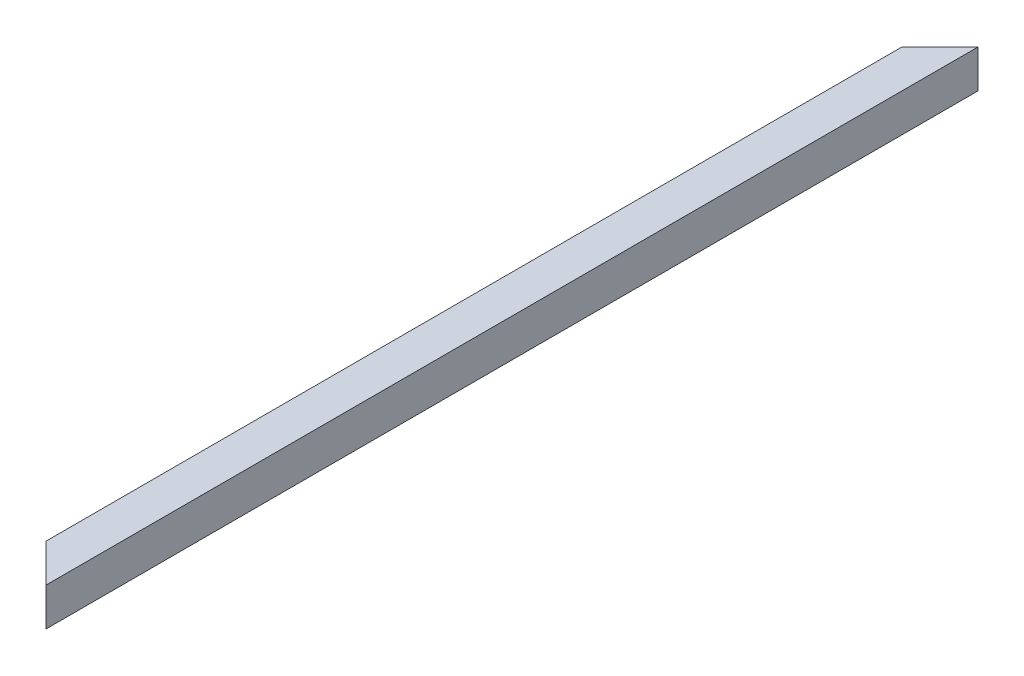
ISO-10303-21;
HEADER;
FILE_DESCRIPTION(('STEP AP214'),'2;1');
FILE_NAME('part.step','',(''),(''),'','','');
FILE_SCHEMA(('AUTOMOTIVE_DESIGN { 1 0 10303 214 1 1 1 1 }'));
ENDSEC;
DATA;
#1=APPLICATION_CONTEXT('core data for automotive mechanical design processes');
#2=APPLICATION_PROTOCOL_DEFINITION('international standard','automotive_design',2000,#1);
#3=PRODUCT_CONTEXT('',#1,'mechanical');
#4=PRODUCT('Part','Part','',(#3));
#5=PRODUCT_RELATED_PRODUCT_CATEGORY('part','',(#4));
#6=PRODUCT_DEFINITION_FORMATION('','',#4);
#7=PRODUCT_DEFINITION_CONTEXT('part definition',#1,'design');
#8=PRODUCT_DEFINITION('design','',#6,#7);
#9=PRODUCT_DEFINITION_SHAPE('','',#8);
#10=(LENGTH_UNIT() NAMED_UNIT(*) SI_UNIT(.MILLI.,.METRE.));
#11=(NAMED_UNIT(*) PLANE_ANGLE_UNIT() SI_UNIT($,.RADIAN.));
#12=(NAMED_UNIT(*) SI_UNIT($,.STERADIAN.) SOLID_ANGLE_UNIT());
#13=UNCERTAINTY_MEASURE_WITH_UNIT(LENGTH_MEASURE(1.E-05),#10,'distance_accuracy_value','');
#14=(GEOMETRIC_REPRESENTATION_CONTEXT(3) GLOBAL_UNCERTAINTY_ASSIGNED_CONTEXT((#13)) GLOBAL_UNIT_ASSIGNED_CONTEXT((#10,
#11,#12)) REPRESENTATION_CONTEXT('',''));
#15=CARTESIAN_POINT('',(0.,0.,0.));
#16=DIRECTION('',(0.,0.,1.));
#17=DIRECTION('',(1.,0.,0.));
#18=AXIS2_PLACEMENT_3D('',#15,#16,#17);
#19=CARTESIAN_POINT('',(-12.7,12.7,-285.75));
#20=DIRECTION('',(0.707106781186547,0.,0.707106781186548));
#21=DIRECTION('',(0.707106781186548,0.,-0.707106781186547));
#22=AXIS2_PLACEMENT_3D('',#19,#20,#21);
#23=PLANE('',#22);
#24=DIRECTION('',(0.707106781186548,0.,-0.707106781186547));
#25=VECTOR('',#24,1.);
#26=CARTESIAN_POINT('',(-77.7875,-12.7,-220.6625));
#27=LINE('',#26,#25);
#28=CARTESIAN_POINT('',(-12.7,-12.7,-285.75));
#29=VERTEX_POINT('',#28);
#30=CARTESIAN_POINT('',(12.7,-12.7,-311.15));
#31=VERTEX_POINT('',#30);
#32=EDGE_CURVE('E34',#29,#31,#27,.T.);
#33=ORIENTED_EDGE('',*,*,#32,.F.);
#34=DIRECTION('',(0.,-1.,0.));
#35=VECTOR('',#34,1.);
#36=CARTESIAN_POINT('',(-12.7,0.,-285.75));
#37=LINE('',#36,#35);
#38=CARTESIAN_POINT('',(-12.7,12.7,-285.75));
#39=VERTEX_POINT('',#38);
#40=EDGE_CURVE('E103',#39,#29,#37,.T.);
#41=ORIENTED_EDGE('',*,*,#40,.F.);
#42=DIRECTION('',(-0.707106781186548,0.,0.707106781186547));
#43=VECTOR('',#42,1.);
#44=CARTESIAN_POINT('',(-84.1375,12.7,-214.3125));
#45=LINE('',#44,#43);
#46=CARTESIAN_POINT('',(12.7,12.7,-311.15));
#47=VERTEX_POINT('',#46);
#48=EDGE_CURVE('E9',#47,#39,#45,.T.);
#49=ORIENTED_EDGE('',*,*,#48,.F.);
#50=DIRECTION('',(0.,1.,0.));
#51=VECTOR('',#50,1.);
#52=CARTESIAN_POINT('',(12.7,12.7,-311.15));
#53=LINE('',#52,#51);
#54=EDGE_CURVE('E113',#31,#47,#53,.T.);
#55=ORIENTED_EDGE('',*,*,#54,.F.);
#56=EDGE_LOOP('',(#33,#41,#49,#55));
#57=FACE_BOUND('',#56,.T.);
#58=DIRECTION('',(0.,1.,0.));
#59=VECTOR('',#58,1.);
#60=CARTESIAN_POINT('',(-9.52500000000001,1.5875,-288.925));
#61=LINE('',#60,#59);
#62=CARTESIAN_POINT('',(-9.525,-9.525,-288.925));
#63=VERTEX_POINT('',#62);
#64=CARTESIAN_POINT('',(-9.525,9.525,-288.925));
#65=VERTEX_POINT('',#64);
#66=EDGE_CURVE('E107',#63,#65,#61,.T.);
#67=ORIENTED_EDGE('',*,*,#66,.F.);
#68=DIRECTION('',(-0.707106781186548,0.,0.707106781186547));
#69=VECTOR('',#68,1.);
#70=CARTESIAN_POINT('',(-78.58125,-9.525,-219.86875));
#71=LINE('',#70,#69);
#72=CARTESIAN_POINT('',(9.525,-9.525,-307.975));
#73=VERTEX_POINT('',#72);
#74=EDGE_CURVE('E144',#73,#63,#71,.T.);
#75=ORIENTED_EDGE('',*,*,#74,.F.);
#76=DIRECTION('',(0.,-1.,0.));
#77=VECTOR('',#76,1.);
#78=CARTESIAN_POINT('',(9.52499999999998,11.1125,-307.975));
#79=LINE('',#78,#77);
#80=CARTESIAN_POINT('',(9.525,9.525,-307.975));
#81=VERTEX_POINT('',#80);
#82=EDGE_CURVE('E129',#81,#73,#79,.T.);
#83=ORIENTED_EDGE('',*,*,#82,.F.);
#84=DIRECTION('',(0.707106781186548,0.,-0.707106781186547));
#85=VECTOR('',#84,1.);
#86=CARTESIAN_POINT('',(-83.34375,9.525,-215.10625));
#87=LINE('',#86,#85);
#88=EDGE_CURVE('E92',#65,#81,#87,.T.);
#89=ORIENTED_EDGE('',*,*,#88,.F.);
#90=EDGE_LOOP('',(#67,#75,#83,#89));
#91=FACE_BOUND('',#90,.T.);
#92=ADVANCED_FACE('F15',(#57,#91),#23,.F.);
#93=CARTESIAN_POINT('',(-12.7,12.7,0.));
#94=DIRECTION('',(0.,1.,0.));
#95=DIRECTION('',(0.,0.,1.));
#96=AXIS2_PLACEMENT_3D('',#93,#94,#95);
#97=PLANE('',#96);
#98=ORIENTED_EDGE('',*,*,#48,.T.);
#99=DIRECTION('',(0.,0.,1.));
#100=VECTOR('',#99,1.);
#101=CARTESIAN_POINT('',(-12.7,12.7,0.));
#102=LINE('',#101,#100);
#103=CARTESIAN_POINT('',(-12.7,12.7,285.75));
#104=VERTEX_POINT('',#103);
#105=EDGE_CURVE('E25',#39,#104,#102,.T.);
#106=ORIENTED_EDGE('',*,*,#105,.T.);
#107=DIRECTION('',(0.707106781186547,0.,0.707106781186548));
#108=VECTOR('',#107,1.);
#109=CARTESIAN_POINT('',(-71.4375,12.7,227.0125));
#110=LINE('',#109,#108);
#111=CARTESIAN_POINT('',(12.7,12.7,311.15));
#112=VERTEX_POINT('',#111);
#113=EDGE_CURVE('E133',#104,#112,#110,.T.);
#114=ORIENTED_EDGE('',*,*,#113,.T.);
#115=DIRECTION('',(0.,0.,-1.));
#116=VECTOR('',#115,1.);
#117=CARTESIAN_POINT('',(12.7,12.7,0.));
#118=LINE('',#117,#116);
#119=EDGE_CURVE('E136',#112,#47,#118,.T.);
#120=ORIENTED_EDGE('',*,*,#119,.T.);
#121=EDGE_LOOP('',(#98,#106,#114,#120));
#122=FACE_BOUND('',#121,.T.);
#123=ADVANCED_FACE('F155',(#122),#97,.T.);
#124=CARTESIAN_POINT('',(9.525,9.525,0.));
#125=DIRECTION('',(1.,0.,0.));
#126=DIRECTION('',(0.,0.,-1.));
#127=AXIS2_PLACEMENT_3D('',#124,#125,#126);
#128=PLANE('',#127);
#129=ORIENTED_EDGE('',*,*,#82,.T.);
#130=DIRECTION('',(0.,0.,1.));
#131=VECTOR('',#130,1.);
#132=CARTESIAN_POINT('',(9.525,-9.525,0.));
#133=LINE('',#132,#131);
#134=CARTESIAN_POINT('',(9.525,-9.525,307.975));
#135=VERTEX_POINT('',#134);
#136=EDGE_CURVE('E139',#73,#135,#133,.T.);
#137=ORIENTED_EDGE('',*,*,#136,.T.);
#138=DIRECTION('',(0.,1.,0.));
#139=VECTOR('',#138,1.);
#140=CARTESIAN_POINT('',(9.52500000000001,11.1125,307.975));
#141=LINE('',#140,#139);
#142=CARTESIAN_POINT('',(9.525,9.525,307.975));
#143=VERTEX_POINT('',#142);
#144=EDGE_CURVE('E142',#135,#143,#141,.T.);
#145=ORIENTED_EDGE('',*,*,#144,.T.);
#146=DIRECTION('',(0.,0.,-1.));
#147=VECTOR('',#146,1.);
#148=CARTESIAN_POINT('',(9.525,9.525,0.));
#149=LINE('',#148,#147);
#150=EDGE_CURVE('E89',#143,#81,#149,.T.);
#151=ORIENTED_EDGE('',*,*,#150,.T.);
#152=EDGE_LOOP('',(#129,#137,#145,#151));
#153=FACE_BOUND('',#152,.T.);
#154=ADVANCED_FACE('F152',(#153),#128,.F.);
#155=CARTESIAN_POINT('',(9.525,-9.525,0.));
#156=DIRECTION('',(0.,-1.,0.));
#157=DIRECTION('',(0.,0.,-1.));
#158=AXIS2_PLACEMENT_3D('',#155,#156,#157);
#159=PLANE('',#158);
#160=ORIENTED_EDGE('',*,*,#74,.T.);
#161=DIRECTION('',(0.,0.,1.));
#162=VECTOR('',#161,1.);
#163=CARTESIAN_POINT('',(-9.525,-9.525,0.));
#164=LINE('',#163,#162);
#165=CARTESIAN_POINT('',(-9.525,-9.525,288.925));
#166=VERTEX_POINT('',#165);
#167=EDGE_CURVE('E145',#63,#166,#164,.T.);
#168=ORIENTED_EDGE('',*,*,#167,.T.);
#169=DIRECTION('',(0.707106781186547,0.,0.707106781186548));
#170=VECTOR('',#169,1.);
#171=CARTESIAN_POINT('',(-65.88125,-9.525,232.56875));
#172=LINE('',#171,#170);
#173=EDGE_CURVE('E99',#166,#135,#172,.T.);
#174=ORIENTED_EDGE('',*,*,#173,.T.);
#175=ORIENTED_EDGE('',*,*,#136,.F.);
#176=EDGE_LOOP('',(#160,#168,#174,#175));
#177=FACE_BOUND('',#176,.T.);
#178=ADVANCED_FACE('F149',(#177),#159,.F.);
#179=CARTESIAN_POINT('',(12.7,12.7,311.15));
#180=DIRECTION('',(0.707106781186548,0.,-0.707106781186547));
#181=DIRECTION('',(-0.707106781186547,0.,-0.707106781186548));
#182=AXIS2_PLACEMENT_3D('',#179,#180,#181);
#183=PLANE('',#182);
#184=DIRECTION('',(-0.707106781186547,0.,-0.707106781186548));
#185=VECTOR('',#184,1.);
#186=CARTESIAN_POINT('',(-65.0875,-12.7,233.3625));
#187=LINE('',#186,#185);
#188=CARTESIAN_POINT('',(12.7,-12.7,311.15));
#189=VERTEX_POINT('',#188);
#190=CARTESIAN_POINT('',(-12.7,-12.7,285.75));
#191=VERTEX_POINT('',#190);
#192=EDGE_CURVE('E77',#189,#191,#187,.T.);
#193=ORIENTED_EDGE('',*,*,#192,.F.);
#194=DIRECTION('',(0.,-1.,0.));
#195=VECTOR('',#194,1.);
#196=CARTESIAN_POINT('',(12.7,12.7,311.15));
#197=LINE('',#196,#195);
#198=EDGE_CURVE('E93',#112,#189,#197,.T.);
#199=ORIENTED_EDGE('',*,*,#198,.F.);
#200=ORIENTED_EDGE('',*,*,#113,.F.);
#201=DIRECTION('',(0.,1.,0.));
#202=VECTOR('',#201,1.);
#203=CARTESIAN_POINT('',(-12.7,0.,285.75));
#204=LINE('',#203,#202);
#205=EDGE_CURVE('E120',#191,#104,#204,.T.);
#206=ORIENTED_EDGE('',*,*,#205,.F.);
#207=EDGE_LOOP('',(#193,#199,#200,#206));
#208=FACE_BOUND('',#207,.T.);
#209=ORIENTED_EDGE('',*,*,#144,.F.);
#210=ORIENTED_EDGE('',*,*,#173,.F.);
#211=DIRECTION('',(0.,-1.,0.));
#212=VECTOR('',#211,1.);
#213=CARTESIAN_POINT('',(-9.525,1.5875,288.925));
#214=LINE('',#213,#212);
#215=CARTESIAN_POINT('',(-9.525,9.525,288.925));
#216=VERTEX_POINT('',#215);
#217=EDGE_CURVE('E96',#216,#166,#214,.T.);
#218=ORIENTED_EDGE('',*,*,#217,.F.);
#219=DIRECTION('',(-0.707106781186547,0.,-0.707106781186548));
#220=VECTOR('',#219,1.);
#221=CARTESIAN_POINT('',(-70.64375,9.525,227.80625));
#222=LINE('',#221,#220);
#223=EDGE_CURVE('E83',#143,#216,#222,.T.);
#224=ORIENTED_EDGE('',*,*,#223,.F.);
#225=EDGE_LOOP('',(#209,#210,#218,#224));
#226=FACE_BOUND('',#225,.T.);
#227=ADVANCED_FACE('F97',(#208,#226),#183,.F.);
#228=CARTESIAN_POINT('',(-9.525,-9.525,0.));
#229=DIRECTION('',(-1.,0.,0.));
#230=DIRECTION('',(0.,0.,1.));
#231=AXIS2_PLACEMENT_3D('',#228,#229,#230);
#232=PLANE('',#231);
#233=ORIENTED_EDGE('',*,*,#66,.T.);
#234=DIRECTION('',(0.,0.,1.));
#235=VECTOR('',#234,1.);
#236=CARTESIAN_POINT('',(-9.525,9.525,0.));
#237=LINE('',#236,#235);
#238=EDGE_CURVE('E87',#65,#216,#237,.T.);
#239=ORIENTED_EDGE('',*,*,#238,.T.);
#240=ORIENTED_EDGE('',*,*,#217,.T.);
#241=ORIENTED_EDGE('',*,*,#167,.F.);
#242=EDGE_LOOP('',(#233,#239,#240,#241));
#243=FACE_BOUND('',#242,.T.);
#244=ADVANCED_FACE('F106',(#243),#232,.F.);
#245=CARTESIAN_POINT('',(-12.7,-12.7,0.));
#246=DIRECTION('',(-1.,0.,0.));
#247=DIRECTION('',(0.,0.,1.));
#248=AXIS2_PLACEMENT_3D('',#245,#246,#247);
#249=PLANE('',#248);
#250=ORIENTED_EDGE('',*,*,#40,.T.);
#251=DIRECTION('',(0.,0.,-1.));
#252=VECTOR('',#251,1.);
#253=CARTESIAN_POINT('',(-12.7,-12.7,0.));
#254=LINE('',#253,#252);
#255=EDGE_CURVE('E110',#191,#29,#254,.T.);
#256=ORIENTED_EDGE('',*,*,#255,.F.);
#257=ORIENTED_EDGE('',*,*,#205,.T.);
#258=ORIENTED_EDGE('',*,*,#105,.F.);
#259=EDGE_LOOP('',(#250,#256,#257,#258));
#260=FACE_BOUND('',#259,.T.);
#261=ADVANCED_FACE('F173',(#260),#249,.T.);
#262=CARTESIAN_POINT('',(-9.525,9.525,0.));
#263=DIRECTION('',(0.,1.,0.));
#264=DIRECTION('',(0.,0.,1.));
#265=AXIS2_PLACEMENT_3D('',#262,#263,#264);
#266=PLANE('',#265);
#267=ORIENTED_EDGE('',*,*,#88,.T.);
#268=ORIENTED_EDGE('',*,*,#150,.F.);
#269=ORIENTED_EDGE('',*,*,#223,.T.);
#270=ORIENTED_EDGE('',*,*,#238,.F.);
#271=EDGE_LOOP('',(#267,#268,#269,#270));
#272=FACE_BOUND('',#271,.T.);
#273=ADVANCED_FACE('F85',(#272),#266,.F.);
#274=CARTESIAN_POINT('',(12.7,12.7,0.));
#275=DIRECTION('',(1.,0.,0.));
#276=DIRECTION('',(0.,0.,-1.));
#277=AXIS2_PLACEMENT_3D('',#274,#275,#276);
#278=PLANE('',#277);
#279=ORIENTED_EDGE('',*,*,#198,.T.);
#280=DIRECTION('',(0.,0.,-1.));
#281=VECTOR('',#280,1.);
#282=CARTESIAN_POINT('',(12.7,-12.7,0.));
#283=LINE('',#282,#281);
#284=EDGE_CURVE('E19',#189,#31,#283,.T.);
#285=ORIENTED_EDGE('',*,*,#284,.T.);
#286=ORIENTED_EDGE('',*,*,#54,.T.);
#287=ORIENTED_EDGE('',*,*,#119,.F.);
#288=EDGE_LOOP('',(#279,#285,#286,#287));
#289=FACE_BOUND('',#288,.T.);
#290=ADVANCED_FACE('F177',(#289),#278,.T.);
#291=CARTESIAN_POINT('',(12.7,-12.7,0.));
#292=DIRECTION('',(0.,-1.,0.));
#293=DIRECTION('',(0.,0.,-1.));
#294=AXIS2_PLACEMENT_3D('',#291,#292,#293);
#295=PLANE('',#294);
#296=ORIENTED_EDGE('',*,*,#32,.T.);
#297=ORIENTED_EDGE('',*,*,#284,.F.);
#298=ORIENTED_EDGE('',*,*,#192,.T.);
#299=ORIENTED_EDGE('',*,*,#255,.T.);
#300=EDGE_LOOP('',(#296,#297,#298,#299));
#301=FACE_BOUND('',#300,.T.);
#302=ADVANCED_FACE('F17',(#301),#295,.T.);
#303=CLOSED_SHELL('',(#92,#123,#154,#178,#227,#244,#261,#273,#290,#302));
#304=MANIFOLD_SOLID_BREP('B1',#303);
#305=ADVANCED_BREP_SHAPE_REPRESENTATION('',(#18,#304),#14);
#306=SHAPE_DEFINITION_REPRESENTATION(#9,#305);
ENDSEC;
END-ISO-10303-21;
